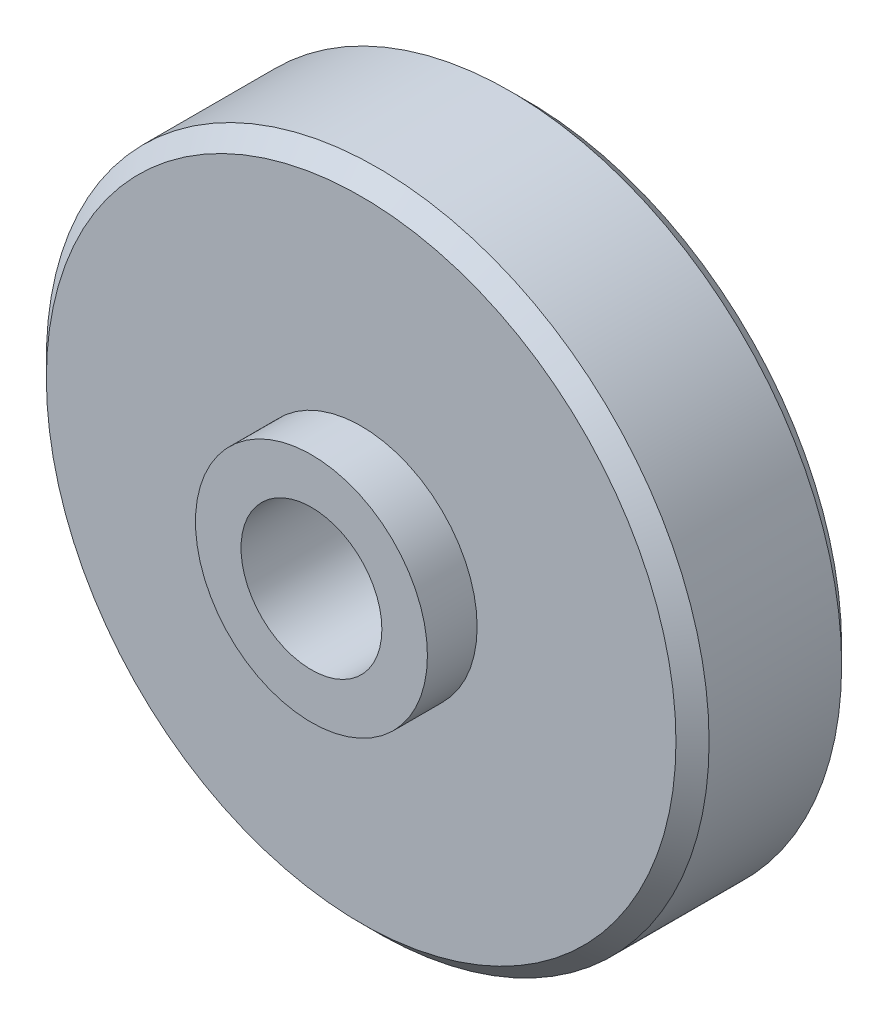
ISO-10303-21;
HEADER;
FILE_DESCRIPTION(('STEP AP214'),'2;1');
FILE_NAME('part.step','',(''),(''),'','','');
FILE_SCHEMA(('AUTOMOTIVE_DESIGN { 1 0 10303 214 1 1 1 1 }'));
ENDSEC;
DATA;
#1=APPLICATION_CONTEXT('core data for automotive mechanical design processes');
#2=APPLICATION_PROTOCOL_DEFINITION('international standard','automotive_design',2000,#1);
#3=PRODUCT_CONTEXT('',#1,'mechanical');
#4=PRODUCT('Part','Part','',(#3));
#5=PRODUCT_RELATED_PRODUCT_CATEGORY('part','',(#4));
#6=PRODUCT_DEFINITION_FORMATION('','',#4);
#7=PRODUCT_DEFINITION_CONTEXT('part definition',#1,'design');
#8=PRODUCT_DEFINITION('design','',#6,#7);
#9=PRODUCT_DEFINITION_SHAPE('','',#8);
#10=(LENGTH_UNIT() NAMED_UNIT(*) SI_UNIT(.MILLI.,.METRE.));
#11=(NAMED_UNIT(*) PLANE_ANGLE_UNIT() SI_UNIT($,.RADIAN.));
#12=(NAMED_UNIT(*) SI_UNIT($,.STERADIAN.) SOLID_ANGLE_UNIT());
#13=UNCERTAINTY_MEASURE_WITH_UNIT(LENGTH_MEASURE(1.E-05),#10,'distance_accuracy_value','');
#14=(GEOMETRIC_REPRESENTATION_CONTEXT(3) GLOBAL_UNCERTAINTY_ASSIGNED_CONTEXT((#13)) GLOBAL_UNIT_ASSIGNED_CONTEXT((#10,
#11,#12)) REPRESENTATION_CONTEXT('',''));
#15=CARTESIAN_POINT('',(0.,0.,0.));
#16=DIRECTION('',(0.,0.,1.));
#17=DIRECTION('',(1.,0.,0.));
#18=AXIS2_PLACEMENT_3D('',#15,#16,#17);
#19=CARTESIAN_POINT('',(0.,0.,10.));
#20=DIRECTION('',(0.,0.,-1.));
#21=DIRECTION('',(-1.,0.,0.));
#22=AXIS2_PLACEMENT_3D('',#19,#20,#21);
#23=CYLINDRICAL_SURFACE('',#22,20.);
#24=CARTESIAN_POINT('',(0.,0.,1.));
#25=DIRECTION('',(0.,0.,1.));
#26=DIRECTION('',(1.,0.,0.));
#27=AXIS2_PLACEMENT_3D('',#24,#25,#26);
#28=CIRCLE('',#27,20.);
#29=CARTESIAN_POINT('',(20.,0.,1.));
#30=VERTEX_POINT('',#29);
#31=EDGE_CURVE('E57',#30,#30,#28,.T.);
#32=ORIENTED_EDGE('',*,*,#31,.T.);
#33=EDGE_LOOP('',(#32));
#34=FACE_BOUND('',#33,.T.);
#35=CARTESIAN_POINT('',(0.,0.,9.00000000000001));
#36=DIRECTION('',(0.,0.,1.));
#37=DIRECTION('',(1.,0.,0.));
#38=AXIS2_PLACEMENT_3D('',#35,#36,#37);
#39=CIRCLE('',#38,20.);
#40=CARTESIAN_POINT('',(20.,0.,9.00000000000001));
#41=VERTEX_POINT('',#40);
#42=EDGE_CURVE('E61',#41,#41,#39,.F.);
#43=ORIENTED_EDGE('',*,*,#42,.T.);
#44=EDGE_LOOP('',(#43));
#45=FACE_BOUND('',#44,.T.);
#46=ADVANCED_FACE('F46',(#34,#45),#23,.T.);
#47=CARTESIAN_POINT('',(0.,0.,10.));
#48=DIRECTION('',(0.,0.,1.));
#49=DIRECTION('',(1.,0.,0.));
#50=AXIS2_PLACEMENT_3D('',#47,#48,#49);
#51=PLANE('',#50);
#52=CARTESIAN_POINT('',(0.,0.,10.));
#53=DIRECTION('',(0.,0.,1.));
#54=DIRECTION('',(1.,0.,0.));
#55=AXIS2_PLACEMENT_3D('',#52,#53,#54);
#56=CIRCLE('',#55,7.);
#57=CARTESIAN_POINT('',(7.,0.,10.));
#58=VERTEX_POINT('',#57);
#59=EDGE_CURVE('E67',#58,#58,#56,.T.);
#60=ORIENTED_EDGE('',*,*,#59,.F.);
#61=EDGE_LOOP('',(#60));
#62=FACE_BOUND('',#61,.T.);
#63=CARTESIAN_POINT('',(0.,0.,10.));
#64=DIRECTION('',(0.,0.,1.));
#65=DIRECTION('',(1.,0.,0.));
#66=AXIS2_PLACEMENT_3D('',#63,#64,#65);
#67=CIRCLE('',#66,19.);
#68=CARTESIAN_POINT('',(19.,0.,10.));
#69=VERTEX_POINT('',#68);
#70=EDGE_CURVE('E12',#69,#69,#67,.T.);
#71=ORIENTED_EDGE('',*,*,#70,.T.);
#72=EDGE_LOOP('',(#71));
#73=FACE_BOUND('',#72,.T.);
#74=ADVANCED_FACE('F93',(#62,#73),#51,.T.);
#75=CARTESIAN_POINT('',(0.,0.,0.));
#76=DIRECTION('',(0.,0.,1.));
#77=DIRECTION('',(1.,0.,0.));
#78=AXIS2_PLACEMENT_3D('',#75,#76,#77);
#79=PLANE('',#78);
#80=CARTESIAN_POINT('',(0.,0.,0.));
#81=DIRECTION('',(0.,0.,1.));
#82=DIRECTION('',(1.,0.,0.));
#83=AXIS2_PLACEMENT_3D('',#80,#81,#82);
#84=CIRCLE('',#83,4.25);
#85=CARTESIAN_POINT('',(4.25,0.,0.));
#86=VERTEX_POINT('',#85);
#87=EDGE_CURVE('E70',#86,#86,#84,.T.);
#88=ORIENTED_EDGE('',*,*,#87,.T.);
#89=EDGE_LOOP('',(#88));
#90=FACE_BOUND('',#89,.T.);
#91=CARTESIAN_POINT('',(0.,0.,0.));
#92=DIRECTION('',(0.,0.,1.));
#93=DIRECTION('',(1.,0.,0.));
#94=AXIS2_PLACEMENT_3D('',#91,#92,#93);
#95=CIRCLE('',#94,19.);
#96=CARTESIAN_POINT('',(19.,0.,0.));
#97=VERTEX_POINT('',#96);
#98=EDGE_CURVE('E53',#97,#97,#95,.F.);
#99=ORIENTED_EDGE('',*,*,#98,.T.);
#100=EDGE_LOOP('',(#99));
#101=FACE_BOUND('',#100,.T.);
#102=ADVANCED_FACE('F95',(#90,#101),#79,.F.);
#103=CARTESIAN_POINT('',(0.,0.,1.));
#104=DIRECTION('',(0.,0.,1.));
#105=DIRECTION('',(1.,0.,0.));
#106=AXIS2_PLACEMENT_3D('',#103,#104,#105);
#107=CONICAL_SURFACE('',#106,20.,0.785398163397452);
#108=ORIENTED_EDGE('',*,*,#98,.F.);
#109=EDGE_LOOP('',(#108));
#110=FACE_BOUND('',#109,.T.);
#111=ORIENTED_EDGE('',*,*,#31,.F.);
#112=EDGE_LOOP('',(#111));
#113=FACE_BOUND('',#112,.T.);
#114=ADVANCED_FACE('F101',(#110,#113),#107,.T.);
#115=CARTESIAN_POINT('',(0.,0.,10.));
#116=DIRECTION('',(0.,0.,-1.));
#117=DIRECTION('',(-1.,0.,0.));
#118=AXIS2_PLACEMENT_3D('',#115,#116,#117);
#119=CONICAL_SURFACE('',#118,19.,0.785398163397448);
#120=ORIENTED_EDGE('',*,*,#42,.F.);
#121=EDGE_LOOP('',(#120));
#122=FACE_BOUND('',#121,.T.);
#123=ORIENTED_EDGE('',*,*,#70,.F.);
#124=EDGE_LOOP('',(#123));
#125=FACE_BOUND('',#124,.T.);
#126=ADVANCED_FACE('F48',(#122,#125),#119,.T.);
#127=CARTESIAN_POINT('',(0.,0.,13.));
#128=DIRECTION('',(0.,0.,-1.));
#129=DIRECTION('',(-1.,0.,0.));
#130=AXIS2_PLACEMENT_3D('',#127,#128,#129);
#131=CYLINDRICAL_SURFACE('',#130,7.);
#132=CARTESIAN_POINT('',(0.,0.,13.));
#133=DIRECTION('',(0.,0.,1.));
#134=DIRECTION('',(1.,0.,0.));
#135=AXIS2_PLACEMENT_3D('',#132,#133,#134);
#136=CIRCLE('',#135,7.);
#137=CARTESIAN_POINT('',(7.,0.,13.));
#138=VERTEX_POINT('',#137);
#139=EDGE_CURVE('E66',#138,#138,#136,.T.);
#140=ORIENTED_EDGE('',*,*,#139,.F.);
#141=EDGE_LOOP('',(#140));
#142=FACE_BOUND('',#141,.T.);
#143=ORIENTED_EDGE('',*,*,#59,.T.);
#144=EDGE_LOOP('',(#143));
#145=FACE_BOUND('',#144,.T.);
#146=ADVANCED_FACE('F84',(#142,#145),#131,.T.);
#147=CARTESIAN_POINT('',(0.,0.,13.));
#148=DIRECTION('',(0.,0.,1.));
#149=DIRECTION('',(1.,0.,0.));
#150=AXIS2_PLACEMENT_3D('',#147,#148,#149);
#151=PLANE('',#150);
#152=CARTESIAN_POINT('',(0.,0.,13.));
#153=DIRECTION('',(0.,0.,1.));
#154=DIRECTION('',(1.,0.,0.));
#155=AXIS2_PLACEMENT_3D('',#152,#153,#154);
#156=CIRCLE('',#155,4.24999999999999);
#157=CARTESIAN_POINT('',(4.24999999999999,0.,13.));
#158=VERTEX_POINT('',#157);
#159=EDGE_CURVE('E75',#158,#158,#156,.T.);
#160=ORIENTED_EDGE('',*,*,#159,.F.);
#161=EDGE_LOOP('',(#160));
#162=FACE_BOUND('',#161,.T.);
#163=ORIENTED_EDGE('',*,*,#139,.T.);
#164=EDGE_LOOP('',(#163));
#165=FACE_BOUND('',#164,.T.);
#166=ADVANCED_FACE('F81',(#162,#165),#151,.T.);
#167=CARTESIAN_POINT('',(0.,0.,13.));
#168=DIRECTION('',(0.,0.,1.));
#169=DIRECTION('',(1.,0.,0.));
#170=AXIS2_PLACEMENT_3D('',#167,#168,#169);
#171=CYLINDRICAL_SURFACE('',#170,4.24999999999999);
#172=ORIENTED_EDGE('',*,*,#87,.F.);
#173=EDGE_LOOP('',(#172));
#174=FACE_BOUND('',#173,.T.);
#175=ORIENTED_EDGE('',*,*,#159,.T.);
#176=EDGE_LOOP('',(#175));
#177=FACE_BOUND('',#176,.T.);
#178=ADVANCED_FACE('F79',(#174,#177),#171,.F.);
#179=CLOSED_SHELL('',(#46,#74,#102,#114,#126,#146,#166,#178));
#180=MANIFOLD_SOLID_BREP('B2',#179);
#181=ADVANCED_BREP_SHAPE_REPRESENTATION('',(#18,#180),#14);
#182=SHAPE_DEFINITION_REPRESENTATION(#9,#181);
ENDSEC;
END-ISO-10303-21;
